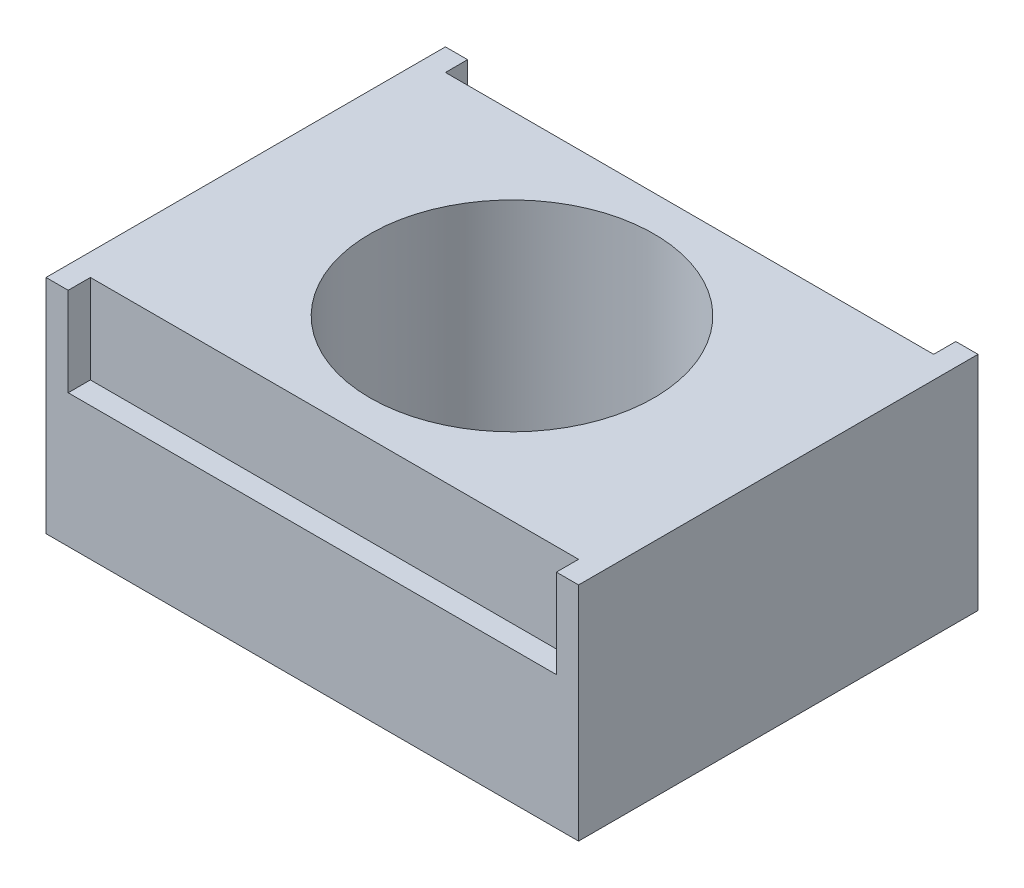
ISO-10303-21;
HEADER;
FILE_DESCRIPTION(('STEP AP214'),'2;1');
FILE_NAME('part.step','',(''),(''),'','','');
FILE_SCHEMA(('AUTOMOTIVE_DESIGN { 1 0 10303 214 1 1 1 1 }'));
ENDSEC;
DATA;
#1=APPLICATION_CONTEXT('core data for automotive mechanical design processes');
#2=APPLICATION_PROTOCOL_DEFINITION('international standard','automotive_design',2000,#1);
#3=PRODUCT_CONTEXT('',#1,'mechanical');
#4=PRODUCT('Part','Part','',(#3));
#5=PRODUCT_RELATED_PRODUCT_CATEGORY('part','',(#4));
#6=PRODUCT_DEFINITION_FORMATION('','',#4);
#7=PRODUCT_DEFINITION_CONTEXT('part definition',#1,'design');
#8=PRODUCT_DEFINITION('design','',#6,#7);
#9=PRODUCT_DEFINITION_SHAPE('','',#8);
#10=(LENGTH_UNIT() NAMED_UNIT(*) SI_UNIT(.MILLI.,.METRE.));
#11=(NAMED_UNIT(*) PLANE_ANGLE_UNIT() SI_UNIT($,.RADIAN.));
#12=(NAMED_UNIT(*) SI_UNIT($,.STERADIAN.) SOLID_ANGLE_UNIT());
#13=UNCERTAINTY_MEASURE_WITH_UNIT(LENGTH_MEASURE(1.E-05),#10,'distance_accuracy_value','');
#14=(GEOMETRIC_REPRESENTATION_CONTEXT(3) GLOBAL_UNCERTAINTY_ASSIGNED_CONTEXT((#13)) GLOBAL_UNIT_ASSIGNED_CONTEXT((#10,
#11,#12)) REPRESENTATION_CONTEXT('',''));
#15=CARTESIAN_POINT('',(0.,0.,0.));
#16=DIRECTION('',(0.,0.,1.));
#17=DIRECTION('',(1.,0.,0.));
#18=AXIS2_PLACEMENT_3D('',#15,#16,#17);
#19=CARTESIAN_POINT('',(0.,0.,0.));
#20=DIRECTION('',(0.,1.,0.));
#21=DIRECTION('',(0.,0.,1.));
#22=AXIS2_PLACEMENT_3D('',#19,#20,#21);
#23=PLANE('',#22);
#24=CARTESIAN_POINT('',(0.,0.,0.));
#25=DIRECTION('',(0.,1.,0.));
#26=DIRECTION('',(0.,0.,1.));
#27=AXIS2_PLACEMENT_3D('',#24,#25,#26);
#28=CIRCLE('',#27,6.4);
#29=CARTESIAN_POINT('',(0.,0.,6.4));
#30=VERTEX_POINT('',#29);
#31=EDGE_CURVE('E291',#30,#30,#28,.T.);
#32=ORIENTED_EDGE('',*,*,#31,.T.);
#33=EDGE_LOOP('',(#32));
#34=FACE_BOUND('',#33,.T.);
#35=CARTESIAN_POINT('',(0.,0.,0.));
#36=DIRECTION('',(0.,1.,0.));
#37=DIRECTION('',(0.,0.,1.));
#38=AXIS2_PLACEMENT_3D('',#35,#36,#37);
#39=CIRCLE('',#38,7.5);
#40=CARTESIAN_POINT('',(0.,0.,7.5));
#41=VERTEX_POINT('',#40);
#42=EDGE_CURVE('E231',#41,#41,#39,.T.);
#43=ORIENTED_EDGE('',*,*,#42,.F.);
#44=EDGE_LOOP('',(#43));
#45=FACE_BOUND('',#44,.T.);
#46=ADVANCED_FACE('F33',(#34,#45),#23,.F.);
#47=CARTESIAN_POINT('',(0.,10.,0.));
#48=DIRECTION('',(0.,1.,0.));
#49=DIRECTION('',(0.,0.,1.));
#50=AXIS2_PLACEMENT_3D('',#47,#48,#49);
#51=PLANE('',#50);
#52=DIRECTION('',(0.,0.,1.));
#53=VECTOR('',#52,1.);
#54=CARTESIAN_POINT('',(-11.,10.,-9.));
#55=LINE('',#54,#53);
#56=CARTESIAN_POINT('',(-11.,10.,-9.));
#57=VERTEX_POINT('',#56);
#58=CARTESIAN_POINT('',(-11.,10.,-8.));
#59=VERTEX_POINT('',#58);
#60=EDGE_CURVE('E281',#57,#59,#55,.T.);
#61=ORIENTED_EDGE('',*,*,#60,.F.);
#62=DIRECTION('',(-1.,0.,0.));
#63=VECTOR('',#62,1.);
#64=CARTESIAN_POINT('',(12.,10.,-9.));
#65=LINE('',#64,#63);
#66=CARTESIAN_POINT('',(-12.,10.,-9.));
#67=VERTEX_POINT('',#66);
#68=EDGE_CURVE('E337',#57,#67,#65,.T.);
#69=ORIENTED_EDGE('',*,*,#68,.T.);
#70=DIRECTION('',(0.,0.,1.));
#71=VECTOR('',#70,1.);
#72=CARTESIAN_POINT('',(-12.,10.,9.));
#73=LINE('',#72,#71);
#74=CARTESIAN_POINT('',(-12.,10.,9.));
#75=VERTEX_POINT('',#74);
#76=EDGE_CURVE('E327',#67,#75,#73,.T.);
#77=ORIENTED_EDGE('',*,*,#76,.T.);
#78=DIRECTION('',(1.,0.,0.));
#79=VECTOR('',#78,1.);
#80=CARTESIAN_POINT('',(12.,10.,9.));
#81=LINE('',#80,#79);
#82=CARTESIAN_POINT('',(-11.,10.,9.));
#83=VERTEX_POINT('',#82);
#84=EDGE_CURVE('E332',#75,#83,#81,.T.);
#85=ORIENTED_EDGE('',*,*,#84,.T.);
#86=DIRECTION('',(0.,0.,1.));
#87=VECTOR('',#86,1.);
#88=CARTESIAN_POINT('',(-11.,10.,9.));
#89=LINE('',#88,#87);
#90=CARTESIAN_POINT('',(-11.,10.,8.));
#91=VERTEX_POINT('',#90);
#92=EDGE_CURVE('E267',#91,#83,#89,.T.);
#93=ORIENTED_EDGE('',*,*,#92,.F.);
#94=DIRECTION('',(-1.,0.,0.));
#95=VECTOR('',#94,1.);
#96=CARTESIAN_POINT('',(-11.,10.,8.));
#97=LINE('',#96,#95);
#98=CARTESIAN_POINT('',(11.,10.,8.));
#99=VERTEX_POINT('',#98);
#100=EDGE_CURVE('E300',#99,#91,#97,.T.);
#101=ORIENTED_EDGE('',*,*,#100,.F.);
#102=DIRECTION('',(0.,0.,-1.));
#103=VECTOR('',#102,1.);
#104=CARTESIAN_POINT('',(11.,10.,9.));
#105=LINE('',#104,#103);
#106=CARTESIAN_POINT('',(11.,10.,9.));
#107=VERTEX_POINT('',#106);
#108=EDGE_CURVE('E309',#107,#99,#105,.T.);
#109=ORIENTED_EDGE('',*,*,#108,.F.);
#110=CARTESIAN_POINT('',(12.,10.,9.));
#111=VERTEX_POINT('',#110);
#112=EDGE_CURVE('E330',#107,#111,#81,.T.);
#113=ORIENTED_EDGE('',*,*,#112,.T.);
#114=DIRECTION('',(0.,0.,-1.));
#115=VECTOR('',#114,1.);
#116=CARTESIAN_POINT('',(12.,10.,9.));
#117=LINE('',#116,#115);
#118=CARTESIAN_POINT('',(12.,10.,-9.));
#119=VERTEX_POINT('',#118);
#120=EDGE_CURVE('E335',#111,#119,#117,.T.);
#121=ORIENTED_EDGE('',*,*,#120,.T.);
#122=CARTESIAN_POINT('',(11.,10.,-9.));
#123=VERTEX_POINT('',#122);
#124=EDGE_CURVE('E338',#119,#123,#65,.T.);
#125=ORIENTED_EDGE('',*,*,#124,.T.);
#126=DIRECTION('',(0.,0.,-1.));
#127=VECTOR('',#126,1.);
#128=CARTESIAN_POINT('',(11.,10.,-9.));
#129=LINE('',#128,#127);
#130=CARTESIAN_POINT('',(11.,10.,-8.));
#131=VERTEX_POINT('',#130);
#132=EDGE_CURVE('E272',#131,#123,#129,.T.);
#133=ORIENTED_EDGE('',*,*,#132,.F.);
#134=DIRECTION('',(1.,0.,0.));
#135=VECTOR('',#134,1.);
#136=CARTESIAN_POINT('',(-11.,10.,-8.));
#137=LINE('',#136,#135);
#138=EDGE_CURVE('E284',#59,#131,#137,.T.);
#139=ORIENTED_EDGE('',*,*,#138,.F.);
#140=EDGE_LOOP('',(#61,#69,#77,#85,#93,#101,#109,#113,#121,#125,#133,#139));
#141=FACE_BOUND('',#140,.T.);
#142=CARTESIAN_POINT('',(0.,10.,0.));
#143=DIRECTION('',(0.,1.,0.));
#144=DIRECTION('',(0.,0.,1.));
#145=AXIS2_PLACEMENT_3D('',#142,#143,#144);
#146=CIRCLE('',#145,6.4);
#147=CARTESIAN_POINT('',(0.,10.,6.4));
#148=VERTEX_POINT('',#147);
#149=EDGE_CURVE('E321',#148,#148,#146,.T.);
#150=ORIENTED_EDGE('',*,*,#149,.F.);
#151=EDGE_LOOP('',(#150));
#152=FACE_BOUND('',#151,.T.);
#153=ADVANCED_FACE('F374',(#141,#152),#51,.T.);
#154=DIRECTION('',(-1.,0.,0.));
#155=VECTOR('',#154,1.);
#156=CARTESIAN_POINT('',(12.,0.,-7.9));
#157=LINE('',#156,#155);
#158=CARTESIAN_POINT('',(10.9,0.,-7.9));
#159=VERTEX_POINT('',#158);
#160=CARTESIAN_POINT('',(-10.9,0.,-7.9));
#161=VERTEX_POINT('',#160);
#162=EDGE_CURVE('E203',#159,#161,#157,.T.);
#163=ORIENTED_EDGE('',*,*,#162,.T.);
#164=DIRECTION('',(0.,0.,1.));
#165=VECTOR('',#164,1.);
#166=CARTESIAN_POINT('',(-10.9,0.,9.));
#167=LINE('',#166,#165);
#168=CARTESIAN_POINT('',(-10.9,0.,7.9));
#169=VERTEX_POINT('',#168);
#170=EDGE_CURVE('E211',#161,#169,#167,.T.);
#171=ORIENTED_EDGE('',*,*,#170,.T.);
#172=DIRECTION('',(1.,0.,0.));
#173=VECTOR('',#172,1.);
#174=CARTESIAN_POINT('',(12.,0.,7.9));
#175=LINE('',#174,#173);
#176=CARTESIAN_POINT('',(10.9,0.,7.9));
#177=VERTEX_POINT('',#176);
#178=EDGE_CURVE('E219',#169,#177,#175,.T.);
#179=ORIENTED_EDGE('',*,*,#178,.T.);
#180=DIRECTION('',(0.,0.,-1.));
#181=VECTOR('',#180,1.);
#182=CARTESIAN_POINT('',(10.9,0.,9.));
#183=LINE('',#182,#181);
#184=EDGE_CURVE('E48',#177,#159,#183,.T.);
#185=ORIENTED_EDGE('',*,*,#184,.T.);
#186=EDGE_LOOP('',(#163,#171,#179,#185));
#187=FACE_BOUND('',#186,.T.);
#188=DIRECTION('',(0.,0.,1.));
#189=VECTOR('',#188,1.);
#190=CARTESIAN_POINT('',(-12.,0.,9.));
#191=LINE('',#190,#189);
#192=CARTESIAN_POINT('',(-12.,0.,-9.));
#193=VERTEX_POINT('',#192);
#194=CARTESIAN_POINT('',(-12.,0.,9.));
#195=VERTEX_POINT('',#194);
#196=EDGE_CURVE('E324',#193,#195,#191,.T.);
#197=ORIENTED_EDGE('',*,*,#196,.F.);
#198=DIRECTION('',(-1.,0.,0.));
#199=VECTOR('',#198,1.);
#200=CARTESIAN_POINT('',(12.,0.,-9.));
#201=LINE('',#200,#199);
#202=CARTESIAN_POINT('',(12.,0.,-9.));
#203=VERTEX_POINT('',#202);
#204=EDGE_CURVE('E331',#203,#193,#201,.T.);
#205=ORIENTED_EDGE('',*,*,#204,.F.);
#206=DIRECTION('',(0.,0.,-1.));
#207=VECTOR('',#206,1.);
#208=CARTESIAN_POINT('',(12.,0.,9.));
#209=LINE('',#208,#207);
#210=CARTESIAN_POINT('',(12.,0.,9.));
#211=VERTEX_POINT('',#210);
#212=EDGE_CURVE('E346',#211,#203,#209,.T.);
#213=ORIENTED_EDGE('',*,*,#212,.F.);
#214=DIRECTION('',(1.,0.,0.));
#215=VECTOR('',#214,1.);
#216=CARTESIAN_POINT('',(12.,0.,9.));
#217=LINE('',#216,#215);
#218=EDGE_CURVE('E344',#195,#211,#217,.T.);
#219=ORIENTED_EDGE('',*,*,#218,.F.);
#220=EDGE_LOOP('',(#197,#205,#213,#219));
#221=FACE_BOUND('',#220,.T.);
#222=ADVANCED_FACE('F222',(#187,#221),#23,.F.);
#223=CARTESIAN_POINT('',(-12.,10.,9.));
#224=DIRECTION('',(1.,0.,0.));
#225=DIRECTION('',(0.,0.,-1.));
#226=AXIS2_PLACEMENT_3D('',#223,#224,#225);
#227=PLANE('',#226);
#228=ORIENTED_EDGE('',*,*,#196,.T.);
#229=DIRECTION('',(0.,-1.,0.));
#230=VECTOR('',#229,1.);
#231=CARTESIAN_POINT('',(-12.,10.,9.));
#232=LINE('',#231,#230);
#233=EDGE_CURVE('E11',#75,#195,#232,.T.);
#234=ORIENTED_EDGE('',*,*,#233,.F.);
#235=ORIENTED_EDGE('',*,*,#76,.F.);
#236=DIRECTION('',(0.,-1.,0.));
#237=VECTOR('',#236,1.);
#238=CARTESIAN_POINT('',(-12.,10.,-9.));
#239=LINE('',#238,#237);
#240=EDGE_CURVE('E341',#67,#193,#239,.T.);
#241=ORIENTED_EDGE('',*,*,#240,.T.);
#242=EDGE_LOOP('',(#228,#234,#235,#241));
#243=FACE_BOUND('',#242,.T.);
#244=ADVANCED_FACE('F35',(#243),#227,.F.);
#245=CARTESIAN_POINT('',(12.,10.,9.));
#246=DIRECTION('',(0.,0.,-1.));
#247=DIRECTION('',(-1.,0.,0.));
#248=AXIS2_PLACEMENT_3D('',#245,#246,#247);
#249=PLANE('',#248);
#250=DIRECTION('',(1.,0.,0.));
#251=VECTOR('',#250,1.);
#252=CARTESIAN_POINT('',(-11.,6.,9.));
#253=LINE('',#252,#251);
#254=CARTESIAN_POINT('',(-11.,6.,9.));
#255=VERTEX_POINT('',#254);
#256=CARTESIAN_POINT('',(11.,6.,9.));
#257=VERTEX_POINT('',#256);
#258=EDGE_CURVE('E299',#255,#257,#253,.T.);
#259=ORIENTED_EDGE('',*,*,#258,.F.);
#260=DIRECTION('',(0.,1.,0.));
#261=VECTOR('',#260,1.);
#262=CARTESIAN_POINT('',(-11.,6.,9.));
#263=LINE('',#262,#261);
#264=EDGE_CURVE('E307',#255,#83,#263,.T.);
#265=ORIENTED_EDGE('',*,*,#264,.T.);
#266=ORIENTED_EDGE('',*,*,#84,.F.);
#267=ORIENTED_EDGE('',*,*,#233,.T.);
#268=ORIENTED_EDGE('',*,*,#218,.T.);
#269=DIRECTION('',(0.,-1.,0.));
#270=VECTOR('',#269,1.);
#271=CARTESIAN_POINT('',(12.,10.,9.));
#272=LINE('',#271,#270);
#273=EDGE_CURVE('E41',#111,#211,#272,.T.);
#274=ORIENTED_EDGE('',*,*,#273,.F.);
#275=ORIENTED_EDGE('',*,*,#112,.F.);
#276=DIRECTION('',(0.,1.,0.));
#277=VECTOR('',#276,1.);
#278=CARTESIAN_POINT('',(11.,6.,9.));
#279=LINE('',#278,#277);
#280=EDGE_CURVE('E317',#257,#107,#279,.T.);
#281=ORIENTED_EDGE('',*,*,#280,.F.);
#282=EDGE_LOOP('',(#259,#265,#266,#267,#268,#274,#275,#281));
#283=FACE_BOUND('',#282,.T.);
#284=ADVANCED_FACE('F394',(#283),#249,.F.);
#285=CARTESIAN_POINT('',(12.,10.,9.));
#286=DIRECTION('',(-1.,0.,0.));
#287=DIRECTION('',(0.,0.,1.));
#288=AXIS2_PLACEMENT_3D('',#285,#286,#287);
#289=PLANE('',#288);
#290=ORIENTED_EDGE('',*,*,#212,.T.);
#291=DIRECTION('',(0.,-1.,0.));
#292=VECTOR('',#291,1.);
#293=CARTESIAN_POINT('',(12.,10.,-9.));
#294=LINE('',#293,#292);
#295=EDGE_CURVE('E351',#119,#203,#294,.T.);
#296=ORIENTED_EDGE('',*,*,#295,.F.);
#297=ORIENTED_EDGE('',*,*,#120,.F.);
#298=ORIENTED_EDGE('',*,*,#273,.T.);
#299=EDGE_LOOP('',(#290,#296,#297,#298));
#300=FACE_BOUND('',#299,.T.);
#301=ADVANCED_FACE('F358',(#300),#289,.F.);
#302=CARTESIAN_POINT('',(12.,10.,-9.));
#303=DIRECTION('',(0.,0.,1.));
#304=DIRECTION('',(1.,0.,0.));
#305=AXIS2_PLACEMENT_3D('',#302,#303,#304);
#306=PLANE('',#305);
#307=ORIENTED_EDGE('',*,*,#68,.F.);
#308=DIRECTION('',(0.,1.,0.));
#309=VECTOR('',#308,1.);
#310=CARTESIAN_POINT('',(-11.,6.,-9.));
#311=LINE('',#310,#309);
#312=CARTESIAN_POINT('',(-11.,6.,-9.));
#313=VERTEX_POINT('',#312);
#314=EDGE_CURVE('E289',#313,#57,#311,.T.);
#315=ORIENTED_EDGE('',*,*,#314,.F.);
#316=DIRECTION('',(-1.,0.,0.));
#317=VECTOR('',#316,1.);
#318=CARTESIAN_POINT('',(-11.,6.,-9.));
#319=LINE('',#318,#317);
#320=CARTESIAN_POINT('',(11.,6.,-9.));
#321=VERTEX_POINT('',#320);
#322=EDGE_CURVE('E277',#321,#313,#319,.T.);
#323=ORIENTED_EDGE('',*,*,#322,.F.);
#324=DIRECTION('',(0.,1.,0.));
#325=VECTOR('',#324,1.);
#326=CARTESIAN_POINT('',(11.,6.,-9.));
#327=LINE('',#326,#325);
#328=EDGE_CURVE('E292',#321,#123,#327,.T.);
#329=ORIENTED_EDGE('',*,*,#328,.T.);
#330=ORIENTED_EDGE('',*,*,#124,.F.);
#331=ORIENTED_EDGE('',*,*,#295,.T.);
#332=ORIENTED_EDGE('',*,*,#204,.T.);
#333=ORIENTED_EDGE('',*,*,#240,.F.);
#334=EDGE_LOOP('',(#307,#315,#323,#329,#330,#331,#332,#333));
#335=FACE_BOUND('',#334,.T.);
#336=ADVANCED_FACE('F367',(#335),#306,.F.);
#337=CARTESIAN_POINT('',(0.,10.,0.));
#338=DIRECTION('',(0.,-1.,0.));
#339=DIRECTION('',(0.,0.,-1.));
#340=AXIS2_PLACEMENT_3D('',#337,#338,#339);
#341=CYLINDRICAL_SURFACE('',#340,6.4);
#342=ORIENTED_EDGE('',*,*,#149,.T.);
#343=EDGE_LOOP('',(#342));
#344=FACE_BOUND('',#343,.T.);
#345=ORIENTED_EDGE('',*,*,#31,.F.);
#346=EDGE_LOOP('',(#345));
#347=FACE_BOUND('',#346,.T.);
#348=ADVANCED_FACE('F434',(#344,#347),#341,.F.);
#349=CARTESIAN_POINT('',(-11.,6.,-9.));
#350=DIRECTION('',(-1.,0.,0.));
#351=DIRECTION('',(0.,0.,1.));
#352=AXIS2_PLACEMENT_3D('',#349,#350,#351);
#353=PLANE('',#352);
#354=ORIENTED_EDGE('',*,*,#60,.T.);
#355=DIRECTION('',(0.,1.,0.));
#356=VECTOR('',#355,1.);
#357=CARTESIAN_POINT('',(-11.,6.,-8.));
#358=LINE('',#357,#356);
#359=CARTESIAN_POINT('',(-11.,6.,-8.));
#360=VERTEX_POINT('',#359);
#361=EDGE_CURVE('E280',#360,#59,#358,.T.);
#362=ORIENTED_EDGE('',*,*,#361,.F.);
#363=DIRECTION('',(0.,0.,1.));
#364=VECTOR('',#363,1.);
#365=CARTESIAN_POINT('',(-11.,6.,-9.));
#366=LINE('',#365,#364);
#367=EDGE_CURVE('E268',#313,#360,#366,.T.);
#368=ORIENTED_EDGE('',*,*,#367,.F.);
#369=ORIENTED_EDGE('',*,*,#314,.T.);
#370=EDGE_LOOP('',(#354,#362,#368,#369));
#371=FACE_BOUND('',#370,.T.);
#372=ADVANCED_FACE('F381',(#371),#353,.F.);
#373=CARTESIAN_POINT('',(11.,6.,-9.));
#374=DIRECTION('',(1.,0.,0.));
#375=DIRECTION('',(0.,0.,-1.));
#376=AXIS2_PLACEMENT_3D('',#373,#374,#375);
#377=PLANE('',#376);
#378=ORIENTED_EDGE('',*,*,#132,.T.);
#379=ORIENTED_EDGE('',*,*,#328,.F.);
#380=DIRECTION('',(0.,0.,-1.));
#381=VECTOR('',#380,1.);
#382=CARTESIAN_POINT('',(11.,6.,-9.));
#383=LINE('',#382,#381);
#384=CARTESIAN_POINT('',(11.,6.,-8.));
#385=VERTEX_POINT('',#384);
#386=EDGE_CURVE('E275',#385,#321,#383,.T.);
#387=ORIENTED_EDGE('',*,*,#386,.F.);
#388=DIRECTION('',(0.,1.,0.));
#389=VECTOR('',#388,1.);
#390=CARTESIAN_POINT('',(11.,6.,-8.));
#391=LINE('',#390,#389);
#392=EDGE_CURVE('E295',#385,#131,#391,.T.);
#393=ORIENTED_EDGE('',*,*,#392,.T.);
#394=EDGE_LOOP('',(#378,#379,#387,#393));
#395=FACE_BOUND('',#394,.T.);
#396=ADVANCED_FACE('F388',(#395),#377,.F.);
#397=CARTESIAN_POINT('',(-11.,6.,-8.));
#398=DIRECTION('',(0.,0.,1.));
#399=DIRECTION('',(1.,0.,0.));
#400=AXIS2_PLACEMENT_3D('',#397,#398,#399);
#401=PLANE('',#400);
#402=ORIENTED_EDGE('',*,*,#138,.T.);
#403=ORIENTED_EDGE('',*,*,#392,.F.);
#404=DIRECTION('',(1.,0.,0.));
#405=VECTOR('',#404,1.);
#406=CARTESIAN_POINT('',(-11.,6.,-8.));
#407=LINE('',#406,#405);
#408=EDGE_CURVE('E271',#360,#385,#407,.T.);
#409=ORIENTED_EDGE('',*,*,#408,.F.);
#410=ORIENTED_EDGE('',*,*,#361,.T.);
#411=EDGE_LOOP('',(#402,#403,#409,#410));
#412=FACE_BOUND('',#411,.T.);
#413=ADVANCED_FACE('F597',(#412),#401,.F.);
#414=CARTESIAN_POINT('',(0.,6.,0.));
#415=DIRECTION('',(0.,1.,0.));
#416=DIRECTION('',(0.,0.,1.));
#417=AXIS2_PLACEMENT_3D('',#414,#415,#416);
#418=PLANE('',#417);
#419=ORIENTED_EDGE('',*,*,#367,.T.);
#420=ORIENTED_EDGE('',*,*,#408,.T.);
#421=ORIENTED_EDGE('',*,*,#386,.T.);
#422=ORIENTED_EDGE('',*,*,#322,.T.);
#423=EDGE_LOOP('',(#419,#420,#421,#422));
#424=FACE_BOUND('',#423,.T.);
#425=ADVANCED_FACE('F384',(#424),#418,.T.);
#426=CARTESIAN_POINT('',(-11.,6.,9.));
#427=DIRECTION('',(-1.,0.,0.));
#428=DIRECTION('',(0.,0.,1.));
#429=AXIS2_PLACEMENT_3D('',#426,#427,#428);
#430=PLANE('',#429);
#431=ORIENTED_EDGE('',*,*,#92,.T.);
#432=ORIENTED_EDGE('',*,*,#264,.F.);
#433=DIRECTION('',(0.,0.,1.));
#434=VECTOR('',#433,1.);
#435=CARTESIAN_POINT('',(-11.,6.,9.));
#436=LINE('',#435,#434);
#437=CARTESIAN_POINT('',(-11.,6.,8.));
#438=VERTEX_POINT('',#437);
#439=EDGE_CURVE('E56',#438,#255,#436,.T.);
#440=ORIENTED_EDGE('',*,*,#439,.F.);
#441=DIRECTION('',(0.,1.,0.));
#442=VECTOR('',#441,1.);
#443=CARTESIAN_POINT('',(-11.,6.,8.));
#444=LINE('',#443,#442);
#445=EDGE_CURVE('E285',#438,#91,#444,.T.);
#446=ORIENTED_EDGE('',*,*,#445,.T.);
#447=EDGE_LOOP('',(#431,#432,#440,#446));
#448=FACE_BOUND('',#447,.T.);
#449=ADVANCED_FACE('F445',(#448),#430,.F.);
#450=CARTESIAN_POINT('',(-11.,6.,8.));
#451=DIRECTION('',(0.,0.,-1.));
#452=DIRECTION('',(-1.,0.,0.));
#453=AXIS2_PLACEMENT_3D('',#450,#451,#452);
#454=PLANE('',#453);
#455=ORIENTED_EDGE('',*,*,#100,.T.);
#456=ORIENTED_EDGE('',*,*,#445,.F.);
#457=DIRECTION('',(-1.,0.,0.));
#458=VECTOR('',#457,1.);
#459=CARTESIAN_POINT('',(-11.,6.,8.));
#460=LINE('',#459,#458);
#461=CARTESIAN_POINT('',(11.,6.,8.));
#462=VERTEX_POINT('',#461);
#463=EDGE_CURVE('E305',#462,#438,#460,.T.);
#464=ORIENTED_EDGE('',*,*,#463,.F.);
#465=DIRECTION('',(0.,1.,0.));
#466=VECTOR('',#465,1.);
#467=CARTESIAN_POINT('',(11.,6.,8.));
#468=LINE('',#467,#466);
#469=EDGE_CURVE('E315',#462,#99,#468,.T.);
#470=ORIENTED_EDGE('',*,*,#469,.T.);
#471=EDGE_LOOP('',(#455,#456,#464,#470));
#472=FACE_BOUND('',#471,.T.);
#473=ADVANCED_FACE('F409',(#472),#454,.F.);
#474=CARTESIAN_POINT('',(11.,6.,9.));
#475=DIRECTION('',(1.,0.,0.));
#476=DIRECTION('',(0.,0.,-1.));
#477=AXIS2_PLACEMENT_3D('',#474,#475,#476);
#478=PLANE('',#477);
#479=ORIENTED_EDGE('',*,*,#108,.T.);
#480=ORIENTED_EDGE('',*,*,#469,.F.);
#481=DIRECTION('',(0.,0.,-1.));
#482=VECTOR('',#481,1.);
#483=CARTESIAN_POINT('',(11.,6.,9.));
#484=LINE('',#483,#482);
#485=EDGE_CURVE('E302',#257,#462,#484,.T.);
#486=ORIENTED_EDGE('',*,*,#485,.F.);
#487=ORIENTED_EDGE('',*,*,#280,.T.);
#488=EDGE_LOOP('',(#479,#480,#486,#487));
#489=FACE_BOUND('',#488,.T.);
#490=ADVANCED_FACE('F396',(#489),#478,.F.);
#491=CARTESIAN_POINT('',(0.,6.,0.));
#492=DIRECTION('',(0.,-1.,0.));
#493=DIRECTION('',(0.,0.,-1.));
#494=AXIS2_PLACEMENT_3D('',#491,#492,#493);
#495=PLANE('',#494);
#496=ORIENTED_EDGE('',*,*,#439,.T.);
#497=ORIENTED_EDGE('',*,*,#258,.T.);
#498=ORIENTED_EDGE('',*,*,#485,.T.);
#499=ORIENTED_EDGE('',*,*,#463,.T.);
#500=EDGE_LOOP('',(#496,#497,#498,#499));
#501=FACE_BOUND('',#500,.T.);
#502=ADVANCED_FACE('F398',(#501),#495,.F.);
#503=CARTESIAN_POINT('',(0.,4.9,0.));
#504=DIRECTION('',(0.,-1.,0.));
#505=DIRECTION('',(0.,0.,-1.));
#506=AXIS2_PLACEMENT_3D('',#503,#504,#505);
#507=PLANE('',#506);
#508=CARTESIAN_POINT('',(0.,4.9,0.));
#509=DIRECTION('',(0.,-1.,0.));
#510=DIRECTION('',(0.,0.,-1.));
#511=AXIS2_PLACEMENT_3D('',#508,#509,#510);
#512=CIRCLE('',#511,7.5);
#513=CARTESIAN_POINT('',(-2.93938769133981,4.9,6.9));
#514=VERTEX_POINT('',#513);
#515=CARTESIAN_POINT('',(2.93938769133982,4.9,6.9));
#516=VERTEX_POINT('',#515);
#517=EDGE_CURVE('E265',#514,#516,#512,.F.);
#518=ORIENTED_EDGE('',*,*,#517,.T.);
#519=DIRECTION('',(-1.,0.,0.));
#520=VECTOR('',#519,1.);
#521=CARTESIAN_POINT('',(-11.,4.9,6.9));
#522=LINE('',#521,#520);
#523=CARTESIAN_POINT('',(10.9,4.9,6.9));
#524=VERTEX_POINT('',#523);
#525=EDGE_CURVE('E679',#524,#516,#522,.T.);
#526=ORIENTED_EDGE('',*,*,#525,.F.);
#527=DIRECTION('',(0.,0.,-1.));
#528=VECTOR('',#527,1.);
#529=CARTESIAN_POINT('',(10.9,4.9,0.));
#530=LINE('',#529,#528);
#531=CARTESIAN_POINT('',(10.9,4.9,7.9));
#532=VERTEX_POINT('',#531);
#533=EDGE_CURVE('E241',#532,#524,#530,.T.);
#534=ORIENTED_EDGE('',*,*,#533,.F.);
#535=DIRECTION('',(1.,0.,0.));
#536=VECTOR('',#535,1.);
#537=CARTESIAN_POINT('',(0.,4.9,7.9));
#538=LINE('',#537,#536);
#539=CARTESIAN_POINT('',(-10.9,4.9,7.9));
#540=VERTEX_POINT('',#539);
#541=EDGE_CURVE('E665',#540,#532,#538,.T.);
#542=ORIENTED_EDGE('',*,*,#541,.F.);
#543=DIRECTION('',(0.,0.,-1.));
#544=VECTOR('',#543,1.);
#545=CARTESIAN_POINT('',(-10.9,4.9,9.));
#546=LINE('',#545,#544);
#547=CARTESIAN_POINT('',(-10.9,4.9,6.9));
#548=VERTEX_POINT('',#547);
#549=EDGE_CURVE('E239',#540,#548,#546,.T.);
#550=ORIENTED_EDGE('',*,*,#549,.T.);
#551=EDGE_CURVE('E669',#514,#548,#522,.T.);
#552=ORIENTED_EDGE('',*,*,#551,.F.);
#553=EDGE_LOOP('',(#518,#526,#534,#542,#550,#552));
#554=FACE_BOUND('',#553,.T.);
#555=ADVANCED_FACE('F400',(#554),#507,.T.);
#556=CARTESIAN_POINT('',(0.,10.,0.));
#557=DIRECTION('',(0.,-1.,0.));
#558=DIRECTION('',(0.,0.,-1.));
#559=AXIS2_PLACEMENT_3D('',#556,#557,#558);
#560=CYLINDRICAL_SURFACE('',#559,7.5);
#561=ORIENTED_EDGE('',*,*,#42,.T.);
#562=EDGE_LOOP('',(#561));
#563=FACE_BOUND('',#562,.T.);
#564=DIRECTION('',(0.,-1.,0.));
#565=VECTOR('',#564,1.);
#566=CARTESIAN_POINT('',(-2.93938769133981,10.,6.9));
#567=LINE('',#566,#565);
#568=CARTESIAN_POINT('',(-2.93938769133981,8.9,6.9));
#569=VERTEX_POINT('',#568);
#570=EDGE_CURVE('E247',#514,#569,#567,.F.);
#571=ORIENTED_EDGE('',*,*,#570,.T.);
#572=CARTESIAN_POINT('',(0.,8.9,0.));
#573=DIRECTION('',(0.,1.,0.));
#574=DIRECTION('',(0.,0.,1.));
#575=AXIS2_PLACEMENT_3D('',#572,#573,#574);
#576=CIRCLE('',#575,7.5);
#577=CARTESIAN_POINT('',(-2.93938769133981,8.9,-6.9));
#578=VERTEX_POINT('',#577);
#579=EDGE_CURVE('E220',#578,#569,#576,.T.);
#580=ORIENTED_EDGE('',*,*,#579,.F.);
#581=DIRECTION('',(0.,-1.,0.));
#582=VECTOR('',#581,1.);
#583=CARTESIAN_POINT('',(-2.93938769133981,10.,-6.9));
#584=LINE('',#583,#582);
#585=CARTESIAN_POINT('',(-2.93938769133981,4.9,-6.9));
#586=VERTEX_POINT('',#585);
#587=EDGE_CURVE('E245',#586,#578,#584,.F.);
#588=ORIENTED_EDGE('',*,*,#587,.F.);
#589=CARTESIAN_POINT('',(0.,4.9,0.));
#590=DIRECTION('',(0.,1.,0.));
#591=DIRECTION('',(0.,0.,1.));
#592=AXIS2_PLACEMENT_3D('',#589,#590,#591);
#593=CIRCLE('',#592,7.5);
#594=CARTESIAN_POINT('',(2.93938769133981,4.9,-6.9));
#595=VERTEX_POINT('',#594);
#596=EDGE_CURVE('E263',#586,#595,#593,.F.);
#597=ORIENTED_EDGE('',*,*,#596,.T.);
#598=DIRECTION('',(0.,-1.,0.));
#599=VECTOR('',#598,1.);
#600=CARTESIAN_POINT('',(2.93938769133981,10.,-6.9));
#601=LINE('',#600,#599);
#602=CARTESIAN_POINT('',(2.93938769133981,8.9,-6.9));
#603=VERTEX_POINT('',#602);
#604=EDGE_CURVE('E243',#595,#603,#601,.F.);
#605=ORIENTED_EDGE('',*,*,#604,.T.);
#606=CARTESIAN_POINT('',(2.93938769133982,8.9,6.9));
#607=VERTEX_POINT('',#606);
#608=EDGE_CURVE('E234',#607,#603,#576,.T.);
#609=ORIENTED_EDGE('',*,*,#608,.F.);
#610=DIRECTION('',(0.,-1.,0.));
#611=VECTOR('',#610,1.);
#612=CARTESIAN_POINT('',(2.93938769133982,10.,6.9));
#613=LINE('',#612,#611);
#614=EDGE_CURVE('E249',#516,#607,#613,.F.);
#615=ORIENTED_EDGE('',*,*,#614,.F.);
#616=ORIENTED_EDGE('',*,*,#517,.F.);
#617=EDGE_LOOP('',(#571,#580,#588,#597,#605,#609,#615,#616));
#618=FACE_BOUND('',#617,.T.);
#619=ADVANCED_FACE('F406',(#563,#618),#560,.T.);
#620=CARTESIAN_POINT('',(-11.,6.,6.9));
#621=DIRECTION('',(0.,0.,-1.));
#622=DIRECTION('',(-1.,0.,0.));
#623=AXIS2_PLACEMENT_3D('',#620,#621,#622);
#624=PLANE('',#623);
#625=DIRECTION('',(0.,-1.,0.));
#626=VECTOR('',#625,1.);
#627=CARTESIAN_POINT('',(10.9,10.,6.9));
#628=LINE('',#627,#626);
#629=CARTESIAN_POINT('',(10.9,8.9,6.9));
#630=VERTEX_POINT('',#629);
#631=EDGE_CURVE('E257',#630,#524,#628,.T.);
#632=ORIENTED_EDGE('',*,*,#631,.T.);
#633=ORIENTED_EDGE('',*,*,#525,.T.);
#634=ORIENTED_EDGE('',*,*,#614,.T.);
#635=DIRECTION('',(-1.,0.,0.));
#636=VECTOR('',#635,1.);
#637=CARTESIAN_POINT('',(0.,8.9,6.9));
#638=LINE('',#637,#636);
#639=EDGE_CURVE('E666',#630,#607,#638,.T.);
#640=ORIENTED_EDGE('',*,*,#639,.F.);
#641=EDGE_LOOP('',(#632,#633,#634,#640));
#642=FACE_BOUND('',#641,.T.);
#643=ADVANCED_FACE('F490',(#642),#624,.T.);
#644=CARTESIAN_POINT('',(-11.,6.,-6.9));
#645=DIRECTION('',(0.,0.,1.));
#646=DIRECTION('',(1.,0.,0.));
#647=AXIS2_PLACEMENT_3D('',#644,#645,#646);
#648=PLANE('',#647);
#649=DIRECTION('',(0.,-1.,0.));
#650=VECTOR('',#649,1.);
#651=CARTESIAN_POINT('',(-10.9,10.,-6.9));
#652=LINE('',#651,#650);
#653=CARTESIAN_POINT('',(-10.9,8.9,-6.9));
#654=VERTEX_POINT('',#653);
#655=CARTESIAN_POINT('',(-10.9,4.9,-6.9));
#656=VERTEX_POINT('',#655);
#657=EDGE_CURVE('E254',#654,#656,#652,.T.);
#658=ORIENTED_EDGE('',*,*,#657,.T.);
#659=DIRECTION('',(1.,0.,0.));
#660=VECTOR('',#659,1.);
#661=CARTESIAN_POINT('',(0.,4.9,-6.9));
#662=LINE('',#661,#660);
#663=EDGE_CURVE('E687',#656,#586,#662,.T.);
#664=ORIENTED_EDGE('',*,*,#663,.T.);
#665=ORIENTED_EDGE('',*,*,#587,.T.);
#666=DIRECTION('',(1.,0.,0.));
#667=VECTOR('',#666,1.);
#668=CARTESIAN_POINT('',(0.,8.9,-6.9));
#669=LINE('',#668,#667);
#670=EDGE_CURVE('E675',#654,#578,#669,.T.);
#671=ORIENTED_EDGE('',*,*,#670,.F.);
#672=EDGE_LOOP('',(#658,#664,#665,#671));
#673=FACE_BOUND('',#672,.T.);
#674=ADVANCED_FACE('F501',(#673),#648,.T.);
#675=CARTESIAN_POINT('',(0.,8.9,0.));
#676=DIRECTION('',(0.,1.,0.));
#677=DIRECTION('',(0.,0.,1.));
#678=AXIS2_PLACEMENT_3D('',#675,#676,#677);
#679=PLANE('',#678);
#680=CARTESIAN_POINT('',(10.9,8.9,-6.9));
#681=VERTEX_POINT('',#680);
#682=EDGE_CURVE('E678',#603,#681,#669,.T.);
#683=ORIENTED_EDGE('',*,*,#682,.T.);
#684=DIRECTION('',(0.,0.,-1.));
#685=VECTOR('',#684,1.);
#686=CARTESIAN_POINT('',(10.9,8.9,9.));
#687=LINE('',#686,#685);
#688=EDGE_CURVE('E208',#630,#681,#687,.T.);
#689=ORIENTED_EDGE('',*,*,#688,.F.);
#690=ORIENTED_EDGE('',*,*,#639,.T.);
#691=ORIENTED_EDGE('',*,*,#608,.T.);
#692=EDGE_LOOP('',(#683,#689,#690,#691));
#693=FACE_BOUND('',#692,.T.);
#694=ADVANCED_FACE('F513',(#693),#679,.F.);
#695=CARTESIAN_POINT('',(-10.9,8.9,6.9));
#696=VERTEX_POINT('',#695);
#697=EDGE_CURVE('E660',#569,#696,#638,.T.);
#698=ORIENTED_EDGE('',*,*,#697,.T.);
#699=DIRECTION('',(0.,0.,1.));
#700=VECTOR('',#699,1.);
#701=CARTESIAN_POINT('',(-10.9,8.9,9.));
#702=LINE('',#701,#700);
#703=EDGE_CURVE('E224',#654,#696,#702,.T.);
#704=ORIENTED_EDGE('',*,*,#703,.F.);
#705=ORIENTED_EDGE('',*,*,#670,.T.);
#706=ORIENTED_EDGE('',*,*,#579,.T.);
#707=EDGE_LOOP('',(#698,#704,#705,#706));
#708=FACE_BOUND('',#707,.T.);
#709=ADVANCED_FACE('F525',(#708),#679,.F.);
#710=CARTESIAN_POINT('',(-10.9,10.,9.));
#711=DIRECTION('',(1.,0.,0.));
#712=DIRECTION('',(0.,0.,-1.));
#713=AXIS2_PLACEMENT_3D('',#710,#711,#712);
#714=PLANE('',#713);
#715=ORIENTED_EDGE('',*,*,#703,.T.);
#716=DIRECTION('',(0.,-1.,0.));
#717=VECTOR('',#716,1.);
#718=CARTESIAN_POINT('',(-10.9,6.,6.9));
#719=LINE('',#718,#717);
#720=EDGE_CURVE('E251',#696,#548,#719,.T.);
#721=ORIENTED_EDGE('',*,*,#720,.T.);
#722=ORIENTED_EDGE('',*,*,#549,.F.);
#723=DIRECTION('',(0.,-1.,0.));
#724=VECTOR('',#723,1.);
#725=CARTESIAN_POINT('',(-10.9,10.,7.9));
#726=LINE('',#725,#724);
#727=EDGE_CURVE('E215',#540,#169,#726,.T.);
#728=ORIENTED_EDGE('',*,*,#727,.T.);
#729=ORIENTED_EDGE('',*,*,#170,.F.);
#730=DIRECTION('',(0.,-1.,0.));
#731=VECTOR('',#730,1.);
#732=CARTESIAN_POINT('',(-10.9,10.,-7.9));
#733=LINE('',#732,#731);
#734=CARTESIAN_POINT('',(-10.9,4.9,-7.9));
#735=VERTEX_POINT('',#734);
#736=EDGE_CURVE('E198',#735,#161,#733,.T.);
#737=ORIENTED_EDGE('',*,*,#736,.F.);
#738=DIRECTION('',(0.,0.,-1.));
#739=VECTOR('',#738,1.);
#740=CARTESIAN_POINT('',(-10.9,4.9,0.));
#741=LINE('',#740,#739);
#742=EDGE_CURVE('E237',#656,#735,#741,.T.);
#743=ORIENTED_EDGE('',*,*,#742,.F.);
#744=ORIENTED_EDGE('',*,*,#657,.F.);
#745=EDGE_LOOP('',(#715,#721,#722,#728,#729,#737,#743,#744));
#746=FACE_BOUND('',#745,.T.);
#747=ADVANCED_FACE('F213',(#746),#714,.T.);
#748=CARTESIAN_POINT('',(12.,10.,7.9));
#749=DIRECTION('',(0.,0.,-1.));
#750=DIRECTION('',(-1.,0.,0.));
#751=AXIS2_PLACEMENT_3D('',#748,#749,#750);
#752=PLANE('',#751);
#753=DIRECTION('',(0.,-1.,0.));
#754=VECTOR('',#753,1.);
#755=CARTESIAN_POINT('',(10.9,10.,7.9));
#756=LINE('',#755,#754);
#757=EDGE_CURVE('E682',#532,#177,#756,.T.);
#758=ORIENTED_EDGE('',*,*,#757,.T.);
#759=ORIENTED_EDGE('',*,*,#178,.F.);
#760=ORIENTED_EDGE('',*,*,#727,.F.);
#761=ORIENTED_EDGE('',*,*,#541,.T.);
#762=EDGE_LOOP('',(#758,#759,#760,#761));
#763=FACE_BOUND('',#762,.T.);
#764=ADVANCED_FACE('F542',(#763),#752,.T.);
#765=CARTESIAN_POINT('',(10.9,10.,9.));
#766=DIRECTION('',(-1.,0.,0.));
#767=DIRECTION('',(0.,0.,1.));
#768=AXIS2_PLACEMENT_3D('',#765,#766,#767);
#769=PLANE('',#768);
#770=DIRECTION('',(0.,-1.,0.));
#771=VECTOR('',#770,1.);
#772=CARTESIAN_POINT('',(10.9,6.,-6.9));
#773=LINE('',#772,#771);
#774=CARTESIAN_POINT('',(10.9,4.9,-6.9));
#775=VERTEX_POINT('',#774);
#776=EDGE_CURVE('E260',#681,#775,#773,.T.);
#777=ORIENTED_EDGE('',*,*,#776,.T.);
#778=DIRECTION('',(0.,0.,-1.));
#779=VECTOR('',#778,1.);
#780=CARTESIAN_POINT('',(10.9,4.9,9.));
#781=LINE('',#780,#779);
#782=CARTESIAN_POINT('',(10.9,4.9,-7.9));
#783=VERTEX_POINT('',#782);
#784=EDGE_CURVE('E235',#775,#783,#781,.T.);
#785=ORIENTED_EDGE('',*,*,#784,.T.);
#786=DIRECTION('',(0.,-1.,0.));
#787=VECTOR('',#786,1.);
#788=CARTESIAN_POINT('',(10.9,10.,-7.9));
#789=LINE('',#788,#787);
#790=EDGE_CURVE('E207',#783,#159,#789,.T.);
#791=ORIENTED_EDGE('',*,*,#790,.T.);
#792=ORIENTED_EDGE('',*,*,#184,.F.);
#793=ORIENTED_EDGE('',*,*,#757,.F.);
#794=ORIENTED_EDGE('',*,*,#533,.T.);
#795=ORIENTED_EDGE('',*,*,#631,.F.);
#796=ORIENTED_EDGE('',*,*,#688,.T.);
#797=EDGE_LOOP('',(#777,#785,#791,#792,#793,#794,#795,#796));
#798=FACE_BOUND('',#797,.T.);
#799=ADVANCED_FACE('F551',(#798),#769,.T.);
#800=CARTESIAN_POINT('',(12.,10.,-7.9));
#801=DIRECTION('',(0.,0.,1.));
#802=DIRECTION('',(1.,0.,0.));
#803=AXIS2_PLACEMENT_3D('',#800,#801,#802);
#804=PLANE('',#803);
#805=ORIENTED_EDGE('',*,*,#736,.T.);
#806=ORIENTED_EDGE('',*,*,#162,.F.);
#807=ORIENTED_EDGE('',*,*,#790,.F.);
#808=DIRECTION('',(-1.,0.,0.));
#809=VECTOR('',#808,1.);
#810=CARTESIAN_POINT('',(12.,4.9,-7.9));
#811=LINE('',#810,#809);
#812=EDGE_CURVE('E205',#783,#735,#811,.T.);
#813=ORIENTED_EDGE('',*,*,#812,.T.);
#814=EDGE_LOOP('',(#805,#806,#807,#813));
#815=FACE_BOUND('',#814,.T.);
#816=ADVANCED_FACE('F200',(#815),#804,.T.);
#817=ORIENTED_EDGE('',*,*,#682,.F.);
#818=ORIENTED_EDGE('',*,*,#604,.F.);
#819=EDGE_CURVE('E688',#595,#775,#662,.T.);
#820=ORIENTED_EDGE('',*,*,#819,.T.);
#821=ORIENTED_EDGE('',*,*,#776,.F.);
#822=EDGE_LOOP('',(#817,#818,#820,#821));
#823=FACE_BOUND('',#822,.T.);
#824=ADVANCED_FACE('F516',(#823),#648,.T.);
#825=CARTESIAN_POINT('',(0.,4.9,0.));
#826=DIRECTION('',(0.,1.,0.));
#827=DIRECTION('',(0.,0.,1.));
#828=AXIS2_PLACEMENT_3D('',#825,#826,#827);
#829=PLANE('',#828);
#830=ORIENTED_EDGE('',*,*,#663,.F.);
#831=ORIENTED_EDGE('',*,*,#742,.T.);
#832=ORIENTED_EDGE('',*,*,#812,.F.);
#833=ORIENTED_EDGE('',*,*,#784,.F.);
#834=ORIENTED_EDGE('',*,*,#819,.F.);
#835=ORIENTED_EDGE('',*,*,#596,.F.);
#836=EDGE_LOOP('',(#830,#831,#832,#833,#834,#835));
#837=FACE_BOUND('',#836,.T.);
#838=ADVANCED_FACE('F575',(#837),#829,.F.);
#839=ORIENTED_EDGE('',*,*,#697,.F.);
#840=ORIENTED_EDGE('',*,*,#570,.F.);
#841=ORIENTED_EDGE('',*,*,#551,.T.);
#842=ORIENTED_EDGE('',*,*,#720,.F.);
#843=EDGE_LOOP('',(#839,#840,#841,#842));
#844=FACE_BOUND('',#843,.T.);
#845=ADVANCED_FACE('F504',(#844),#624,.T.);
#846=CLOSED_SHELL('',(#46,#153,#222,#244,#284,#301,#336,#348,#372,#396,#413,#425,#449,#473,#490,
#502,#555,#619,#643,#674,#694,#709,#747,#764,#799,#816,#824,#838,#845));
#847=MANIFOLD_SOLID_BREP('B2',#846);
#848=ADVANCED_BREP_SHAPE_REPRESENTATION('',(#18,#847),#14);
#849=SHAPE_DEFINITION_REPRESENTATION(#9,#848);
ENDSEC;
END-ISO-10303-21;
